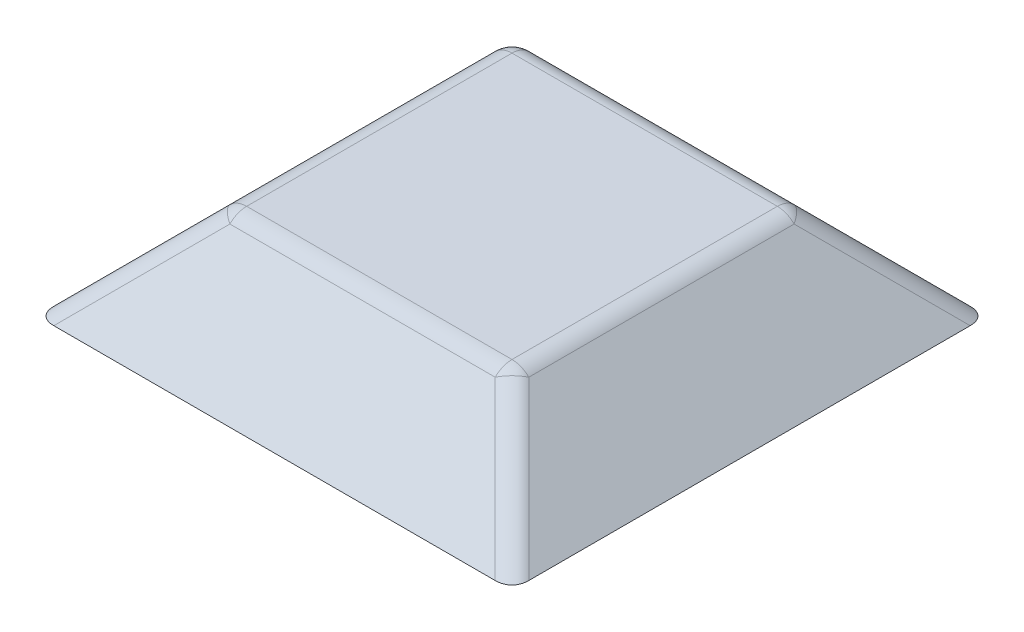
ISO-10303-21;
HEADER;
FILE_DESCRIPTION(('STEP AP214'),'2;1');
FILE_NAME('part.step','',(''),(''),'','','');
FILE_SCHEMA(('AUTOMOTIVE_DESIGN { 1 0 10303 214 1 1 1 1 }'));
ENDSEC;
DATA;
#1=APPLICATION_CONTEXT('core data for automotive mechanical design processes');
#2=APPLICATION_PROTOCOL_DEFINITION('international standard','automotive_design',2000,#1);
#3=PRODUCT_CONTEXT('',#1,'mechanical');
#4=PRODUCT('Part','Part','',(#3));
#5=PRODUCT_RELATED_PRODUCT_CATEGORY('part','',(#4));
#6=PRODUCT_DEFINITION_FORMATION('','',#4);
#7=PRODUCT_DEFINITION_CONTEXT('part definition',#1,'design');
#8=PRODUCT_DEFINITION('design','',#6,#7);
#9=PRODUCT_DEFINITION_SHAPE('','',#8);
#10=(LENGTH_UNIT() NAMED_UNIT(*) SI_UNIT(.MILLI.,.METRE.));
#11=(NAMED_UNIT(*) PLANE_ANGLE_UNIT() SI_UNIT($,.RADIAN.));
#12=(NAMED_UNIT(*) SI_UNIT($,.STERADIAN.) SOLID_ANGLE_UNIT());
#13=UNCERTAINTY_MEASURE_WITH_UNIT(LENGTH_MEASURE(1.E-05),#10,'distance_accuracy_value','');
#14=(GEOMETRIC_REPRESENTATION_CONTEXT(3) GLOBAL_UNCERTAINTY_ASSIGNED_CONTEXT((#13)) GLOBAL_UNIT_ASSIGNED_CONTEXT((#10,
#11,#12)) REPRESENTATION_CONTEXT('',''));
#15=CARTESIAN_POINT('',(0.,0.,0.));
#16=DIRECTION('',(0.,0.,1.));
#17=DIRECTION('',(1.,0.,0.));
#18=AXIS2_PLACEMENT_3D('',#15,#16,#17);
#19=CARTESIAN_POINT('',(-5.,0.,5.));
#20=DIRECTION('',(-0.707106781186546,0.707106781186549,0.));
#21=DIRECTION('',(-0.707106781186549,-0.707106781186546,0.));
#22=AXIS2_PLACEMENT_3D('',#19,#20,#21);
#23=PLANE('',#22);
#24=DIRECTION('',(0.,0.,1.));
#25=VECTOR('',#24,1.);
#26=CARTESIAN_POINT('',(-5.,0.,5.));
#27=LINE('',#26,#25);
#28=CARTESIAN_POINT('',(-5.,0.,-4.64644660940673));
#29=VERTEX_POINT('',#28);
#30=CARTESIAN_POINT('',(-5.,0.,4.64644660940673));
#31=VERTEX_POINT('',#30);
#32=EDGE_CURVE('E153',#29,#31,#27,.T.);
#33=ORIENTED_EDGE('',*,*,#32,.T.);
#34=DIRECTION('',(0.577350269189627,0.577350269189624,-0.577350269189627));
#35=VECTOR('',#34,1.);
#36=CARTESIAN_POINT('',(-5.11785113019776,-0.117851130197757,4.76429773960449));
#37=LINE('',#36,#35);
#38=CARTESIAN_POINT('',(-3.14644660940672,1.85355339059327,2.79289321881345));
#39=VERTEX_POINT('',#38);
#40=EDGE_CURVE('E11',#31,#39,#37,.T.);
#41=ORIENTED_EDGE('',*,*,#40,.T.);
#42=DIRECTION('',(0.,0.,1.));
#43=VECTOR('',#42,1.);
#44=CARTESIAN_POINT('',(-3.14644660940672,1.85355339059327,-2.99999999999999));
#45=LINE('',#44,#43);
#46=CARTESIAN_POINT('',(-3.14644660940672,1.85355339059327,-2.79289321881345));
#47=VERTEX_POINT('',#46);
#48=EDGE_CURVE('E49',#39,#47,#45,.F.);
#49=ORIENTED_EDGE('',*,*,#48,.T.);
#50=DIRECTION('',(0.577350269189627,0.577350269189624,0.577350269189627));
#51=VECTOR('',#50,1.);
#52=CARTESIAN_POINT('',(-1.78451779686442,3.21548220313557,-1.43096440627114));
#53=LINE('',#52,#51);
#54=EDGE_CURVE('E42',#47,#29,#53,.F.);
#55=ORIENTED_EDGE('',*,*,#54,.T.);
#56=EDGE_LOOP('',(#33,#41,#49,#55));
#57=FACE_BOUND('',#56,.T.);
#58=ADVANCED_FACE('F33',(#57),#23,.T.);
#59=CARTESIAN_POINT('',(5.,0.,5.));
#60=DIRECTION('',(0.,0.707106781186549,0.707106781186546));
#61=DIRECTION('',(0.,-0.707106781186546,0.707106781186549));
#62=AXIS2_PLACEMENT_3D('',#59,#60,#61);
#63=PLANE('',#62);
#64=DIRECTION('',(1.,0.,0.));
#65=VECTOR('',#64,1.);
#66=CARTESIAN_POINT('',(5.,0.,5.));
#67=LINE('',#66,#65);
#68=CARTESIAN_POINT('',(-4.64644660940673,0.,5.));
#69=VERTEX_POINT('',#68);
#70=CARTESIAN_POINT('',(4.64644660940672,0.,5.));
#71=VERTEX_POINT('',#70);
#72=EDGE_CURVE('E155',#69,#71,#67,.T.);
#73=ORIENTED_EDGE('',*,*,#72,.T.);
#74=DIRECTION('',(-0.577350269189627,0.577350269189625,-0.577350269189626));
#75=VECTOR('',#74,1.);
#76=CARTESIAN_POINT('',(4.76429773960448,-0.117851130197758,5.11785113019776));
#77=LINE('',#76,#75);
#78=CARTESIAN_POINT('',(2.79289321881344,1.85355339059327,3.14644660940672));
#79=VERTEX_POINT('',#78);
#80=EDGE_CURVE('E193',#71,#79,#77,.T.);
#81=ORIENTED_EDGE('',*,*,#80,.T.);
#82=DIRECTION('',(1.,0.,0.));
#83=VECTOR('',#82,1.);
#84=CARTESIAN_POINT('',(-3.,1.85355339059327,3.14644660940672));
#85=LINE('',#84,#83);
#86=CARTESIAN_POINT('',(-2.79289321881345,1.85355339059327,3.14644660940672));
#87=VERTEX_POINT('',#86);
#88=EDGE_CURVE('E189',#79,#87,#85,.F.);
#89=ORIENTED_EDGE('',*,*,#88,.T.);
#90=DIRECTION('',(0.577350269189626,0.577350269189624,-0.577350269189627));
#91=VECTOR('',#90,1.);
#92=CARTESIAN_POINT('',(-1.43096440627115,3.21548220313557,1.78451779686442));
#93=LINE('',#92,#91);
#94=EDGE_CURVE('E191',#87,#69,#93,.F.);
#95=ORIENTED_EDGE('',*,*,#94,.T.);
#96=EDGE_LOOP('',(#73,#81,#89,#95));
#97=FACE_BOUND('',#96,.T.);
#98=ADVANCED_FACE('F245',(#97),#63,.T.);
#99=CARTESIAN_POINT('',(5.,0.,5.));
#100=DIRECTION('',(0.707106781186546,0.707106781186549,0.));
#101=DIRECTION('',(-0.707106781186549,0.707106781186546,0.));
#102=AXIS2_PLACEMENT_3D('',#99,#100,#101);
#103=PLANE('',#102);
#104=DIRECTION('',(0.,0.,-1.));
#105=VECTOR('',#104,1.);
#106=CARTESIAN_POINT('',(5.,0.,5.));
#107=LINE('',#106,#105);
#108=CARTESIAN_POINT('',(5.,0.,4.64644660940673));
#109=VERTEX_POINT('',#108);
#110=CARTESIAN_POINT('',(5.,0.,-4.64644660940673));
#111=VERTEX_POINT('',#110);
#112=EDGE_CURVE('E159',#109,#111,#107,.T.);
#113=ORIENTED_EDGE('',*,*,#112,.T.);
#114=DIRECTION('',(-0.577350269189627,0.577350269189624,0.577350269189627));
#115=VECTOR('',#114,1.);
#116=CARTESIAN_POINT('',(1.78451779686441,3.21548220313557,-1.43096440627114));
#117=LINE('',#116,#115);
#118=CARTESIAN_POINT('',(3.14644660940672,1.85355339059327,-2.79289321881345));
#119=VERTEX_POINT('',#118);
#120=EDGE_CURVE('E179',#111,#119,#117,.T.);
#121=ORIENTED_EDGE('',*,*,#120,.T.);
#122=DIRECTION('',(0.,0.,-1.));
#123=VECTOR('',#122,1.);
#124=CARTESIAN_POINT('',(3.14644660940672,1.85355339059327,2.99999999999999));
#125=LINE('',#124,#123);
#126=CARTESIAN_POINT('',(3.14644660940672,1.85355339059327,2.79289321881345));
#127=VERTEX_POINT('',#126);
#128=EDGE_CURVE('E177',#119,#127,#125,.F.);
#129=ORIENTED_EDGE('',*,*,#128,.T.);
#130=DIRECTION('',(-0.577350269189627,0.577350269189624,-0.577350269189626));
#131=VECTOR('',#130,1.);
#132=CARTESIAN_POINT('',(5.11785113019775,-0.117851130197758,4.76429773960449));
#133=LINE('',#132,#131);
#134=EDGE_CURVE('E175',#127,#109,#133,.F.);
#135=ORIENTED_EDGE('',*,*,#134,.T.);
#136=EDGE_LOOP('',(#113,#121,#129,#135));
#137=FACE_BOUND('',#136,.T.);
#138=ADVANCED_FACE('F250',(#137),#103,.T.);
#139=CARTESIAN_POINT('',(5.,0.,-5.));
#140=DIRECTION('',(0.,0.707106781186549,-0.707106781186546));
#141=DIRECTION('',(0.,0.707106781186546,0.707106781186549));
#142=AXIS2_PLACEMENT_3D('',#139,#140,#141);
#143=PLANE('',#142);
#144=DIRECTION('',(-1.,0.,0.));
#145=VECTOR('',#144,1.);
#146=CARTESIAN_POINT('',(2.99999999999999,1.85355339059327,-3.14644660940672));
#147=LINE('',#146,#145);
#148=CARTESIAN_POINT('',(-2.79289321881345,1.85355339059327,-3.14644660940672));
#149=VERTEX_POINT('',#148);
#150=CARTESIAN_POINT('',(2.79289321881344,1.85355339059327,-3.14644660940672));
#151=VERTEX_POINT('',#150);
#152=EDGE_CURVE('E170',#149,#151,#147,.F.);
#153=ORIENTED_EDGE('',*,*,#152,.T.);
#154=DIRECTION('',(-0.577350269189627,0.577350269189624,0.577350269189627));
#155=VECTOR('',#154,1.);
#156=CARTESIAN_POINT('',(4.76429773960448,-0.117851130197758,-5.11785113019776));
#157=LINE('',#156,#155);
#158=CARTESIAN_POINT('',(4.64644660940672,0.,-5.));
#159=VERTEX_POINT('',#158);
#160=EDGE_CURVE('E173',#151,#159,#157,.F.);
#161=ORIENTED_EDGE('',*,*,#160,.T.);
#162=DIRECTION('',(-1.,0.,0.));
#163=VECTOR('',#162,1.);
#164=CARTESIAN_POINT('',(5.,0.,-5.));
#165=LINE('',#164,#163);
#166=CARTESIAN_POINT('',(-4.64644660940673,0.,-5.));
#167=VERTEX_POINT('',#166);
#168=EDGE_CURVE('E132',#159,#167,#165,.T.);
#169=ORIENTED_EDGE('',*,*,#168,.T.);
#170=DIRECTION('',(0.577350269189627,0.577350269189624,0.577350269189627));
#171=VECTOR('',#170,1.);
#172=CARTESIAN_POINT('',(-1.43096440627115,3.21548220313557,-1.78451779686442));
#173=LINE('',#172,#171);
#174=EDGE_CURVE('E168',#167,#149,#173,.T.);
#175=ORIENTED_EDGE('',*,*,#174,.T.);
#176=EDGE_LOOP('',(#153,#161,#169,#175));
#177=FACE_BOUND('',#176,.T.);
#178=ADVANCED_FACE('F226',(#177),#143,.T.);
#179=CARTESIAN_POINT('',(0.,2.,0.));
#180=DIRECTION('',(0.,1.,0.));
#181=DIRECTION('',(0.,0.,1.));
#182=AXIS2_PLACEMENT_3D('',#179,#180,#181);
#183=PLANE('',#182);
#184=DIRECTION('',(0.,0.,1.));
#185=VECTOR('',#184,1.);
#186=CARTESIAN_POINT('',(2.79289321881344,2.,-2.99999999999999));
#187=LINE('',#186,#185);
#188=CARTESIAN_POINT('',(2.79289321881344,2.,2.79289321881345));
#189=VERTEX_POINT('',#188);
#190=CARTESIAN_POINT('',(2.79289321881344,2.,-2.79289321881345));
#191=VERTEX_POINT('',#190);
#192=EDGE_CURVE('E120',#189,#191,#187,.F.);
#193=ORIENTED_EDGE('',*,*,#192,.T.);
#194=DIRECTION('',(1.,0.,0.));
#195=VECTOR('',#194,1.);
#196=CARTESIAN_POINT('',(-3.,2.,-2.79289321881345));
#197=LINE('',#196,#195);
#198=CARTESIAN_POINT('',(-2.79289321881345,2.,-2.79289321881345));
#199=VERTEX_POINT('',#198);
#200=EDGE_CURVE('E116',#191,#199,#197,.F.);
#201=ORIENTED_EDGE('',*,*,#200,.T.);
#202=DIRECTION('',(0.,0.,-1.));
#203=VECTOR('',#202,1.);
#204=CARTESIAN_POINT('',(-2.79289321881345,2.,2.99999999999999));
#205=LINE('',#204,#203);
#206=CARTESIAN_POINT('',(-2.79289321881345,2.,2.79289321881345));
#207=VERTEX_POINT('',#206);
#208=EDGE_CURVE('E110',#199,#207,#205,.F.);
#209=ORIENTED_EDGE('',*,*,#208,.T.);
#210=DIRECTION('',(-1.,0.,0.));
#211=VECTOR('',#210,1.);
#212=CARTESIAN_POINT('',(2.99999999999999,2.,2.79289321881345));
#213=LINE('',#212,#211);
#214=EDGE_CURVE('E113',#207,#189,#213,.F.);
#215=ORIENTED_EDGE('',*,*,#214,.T.);
#216=EDGE_LOOP('',(#193,#201,#209,#215));
#217=FACE_BOUND('',#216,.T.);
#218=ADVANCED_FACE('F112',(#217),#183,.T.);
#219=CARTESIAN_POINT('',(0.,0.,0.));
#220=DIRECTION('',(0.,1.,0.));
#221=DIRECTION('',(0.,0.,1.));
#222=AXIS2_PLACEMENT_3D('',#219,#220,#221);
#223=PLANE('',#222);
#224=ORIENTED_EDGE('',*,*,#168,.F.);
#225=CARTESIAN_POINT('',(4.29289321881345,0.,-4.29289321881345));
#226=DIRECTION('',(0.,1.,0.));
#227=DIRECTION('',(0.707106781186548,0.,-0.707106781186548));
#228=AXIS2_PLACEMENT_3D('',#225,#226,#227);
#229=ELLIPSE('',#228,0.866025403784441,0.5);
#230=EDGE_CURVE('E187',#159,#111,#229,.F.);
#231=ORIENTED_EDGE('',*,*,#230,.T.);
#232=ORIENTED_EDGE('',*,*,#112,.F.);
#233=CARTESIAN_POINT('',(4.29289321881345,0.,4.29289321881345));
#234=DIRECTION('',(0.,1.,0.));
#235=DIRECTION('',(0.707106781186548,0.,0.707106781186547));
#236=AXIS2_PLACEMENT_3D('',#233,#234,#235);
#237=ELLIPSE('',#236,0.866025403784441,0.5);
#238=EDGE_CURVE('E185',#109,#71,#237,.F.);
#239=ORIENTED_EDGE('',*,*,#238,.T.);
#240=ORIENTED_EDGE('',*,*,#72,.F.);
#241=CARTESIAN_POINT('',(-4.29289321881345,0.,4.29289321881345));
#242=DIRECTION('',(0.,1.,0.));
#243=DIRECTION('',(-0.707106781186547,0.,0.707106781186548));
#244=AXIS2_PLACEMENT_3D('',#241,#242,#243);
#245=ELLIPSE('',#244,0.866025403784441,0.5);
#246=EDGE_CURVE('E183',#69,#31,#245,.F.);
#247=ORIENTED_EDGE('',*,*,#246,.T.);
#248=ORIENTED_EDGE('',*,*,#32,.F.);
#249=CARTESIAN_POINT('',(-4.29289321881345,0.,-4.29289321881345));
#250=DIRECTION('',(0.,1.,0.));
#251=DIRECTION('',(-0.707106781186548,0.,-0.707106781186548));
#252=AXIS2_PLACEMENT_3D('',#249,#250,#251);
#253=ELLIPSE('',#252,0.866025403784441,0.5);
#254=EDGE_CURVE('E181',#29,#167,#253,.F.);
#255=ORIENTED_EDGE('',*,*,#254,.T.);
#256=EDGE_LOOP('',(#224,#231,#232,#239,#240,#247,#248,#255));
#257=FACE_BOUND('',#256,.T.);
#258=ADVANCED_FACE('F238',(#257),#223,.F.);
#259=CARTESIAN_POINT('',(4.76429773960448,-0.471404520791032,4.76429773960449));
#260=DIRECTION('',(0.577350269189627,-0.577350269189624,0.577350269189626));
#261=DIRECTION('',(0.707106781186547,0.,-0.707106781186548));
#262=AXIS2_PLACEMENT_3D('',#259,#260,#261);
#263=CYLINDRICAL_SURFACE('',#262,0.5);
#264=ORIENTED_EDGE('',*,*,#238,.F.);
#265=ORIENTED_EDGE('',*,*,#134,.F.);
#266=CARTESIAN_POINT('',(2.79289321881344,1.5,2.79289321881345));
#267=DIRECTION('',(-0.577350269189626,0.577350269189625,-0.577350269189627));
#268=DIRECTION('',(-0.707106781186548,0.,0.707106781186547));
#269=AXIS2_PLACEMENT_3D('',#266,#267,#268);
#270=CIRCLE('',#269,0.5);
#271=EDGE_CURVE('E37',#79,#127,#270,.T.);
#272=ORIENTED_EDGE('',*,*,#271,.F.);
#273=ORIENTED_EDGE('',*,*,#80,.F.);
#274=EDGE_LOOP('',(#264,#265,#272,#273));
#275=FACE_BOUND('',#274,.T.);
#276=ADVANCED_FACE('F35',(#275),#263,.T.);
#277=CARTESIAN_POINT('',(0.,1.5,2.79289321881345));
#278=DIRECTION('',(1.,0.,0.));
#279=DIRECTION('',(0.,0.,-1.));
#280=AXIS2_PLACEMENT_3D('',#277,#278,#279);
#281=CYLINDRICAL_SURFACE('',#280,0.5);
#282=CARTESIAN_POINT('',(-2.79289321881345,1.5,2.79289321881345));
#283=DIRECTION('',(-1.,0.,0.));
#284=DIRECTION('',(0.,0.,1.));
#285=AXIS2_PLACEMENT_3D('',#282,#283,#284);
#286=CIRCLE('',#285,0.5);
#287=EDGE_CURVE('E127',#87,#207,#286,.T.);
#288=ORIENTED_EDGE('',*,*,#287,.F.);
#289=ORIENTED_EDGE('',*,*,#88,.F.);
#290=CARTESIAN_POINT('',(2.79289321881344,1.5,2.79289321881345));
#291=DIRECTION('',(1.,0.,0.));
#292=DIRECTION('',(0.,0.,-1.));
#293=AXIS2_PLACEMENT_3D('',#290,#291,#292);
#294=CIRCLE('',#293,0.5);
#295=EDGE_CURVE('E130',#189,#79,#294,.T.);
#296=ORIENTED_EDGE('',*,*,#295,.F.);
#297=ORIENTED_EDGE('',*,*,#214,.F.);
#298=EDGE_LOOP('',(#288,#289,#296,#297));
#299=FACE_BOUND('',#298,.T.);
#300=ADVANCED_FACE('F125',(#299),#281,.T.);
#301=CARTESIAN_POINT('',(-1.43096440627115,2.8619288125423,1.43096440627115));
#302=DIRECTION('',(-0.577350269189626,-0.577350269189624,0.577350269189627));
#303=DIRECTION('',(0.707106781186548,0.,0.707106781186547));
#304=AXIS2_PLACEMENT_3D('',#301,#302,#303);
#305=CYLINDRICAL_SURFACE('',#304,0.5);
#306=ORIENTED_EDGE('',*,*,#246,.F.);
#307=ORIENTED_EDGE('',*,*,#94,.F.);
#308=CARTESIAN_POINT('',(-2.79289321881345,1.5,2.79289321881345));
#309=DIRECTION('',(0.577350269189625,0.577350269189623,-0.577350269189629));
#310=DIRECTION('',(-0.70710678118655,0.,-0.707106781186545));
#311=AXIS2_PLACEMENT_3D('',#308,#309,#310);
#312=CIRCLE('',#311,0.5);
#313=EDGE_CURVE('E138',#39,#87,#312,.T.);
#314=ORIENTED_EDGE('',*,*,#313,.F.);
#315=ORIENTED_EDGE('',*,*,#40,.F.);
#316=EDGE_LOOP('',(#306,#307,#314,#315));
#317=FACE_BOUND('',#316,.T.);
#318=ADVANCED_FACE('F243',(#317),#305,.T.);
#319=CARTESIAN_POINT('',(2.79289321881344,1.5,2.79289321881345));
#320=DIRECTION('',(0.,0.,1.));
#321=DIRECTION('',(1.,0.,0.));
#322=AXIS2_PLACEMENT_3D('',#319,#320,#321);
#323=SPHERICAL_SURFACE('',#322,0.5);
#324=ORIENTED_EDGE('',*,*,#295,.T.);
#325=ORIENTED_EDGE('',*,*,#271,.T.);
#326=CARTESIAN_POINT('',(2.79289321881344,1.5,2.79289321881345));
#327=DIRECTION('',(0.,0.,1.));
#328=DIRECTION('',(1.,0.,0.));
#329=AXIS2_PLACEMENT_3D('',#326,#327,#328);
#330=CIRCLE('',#329,0.5);
#331=EDGE_CURVE('E141',#189,#127,#330,.F.);
#332=ORIENTED_EDGE('',*,*,#331,.F.);
#333=EDGE_LOOP('',(#324,#325,#332));
#334=FACE_BOUND('',#333,.T.);
#335=ADVANCED_FACE('F291',(#334),#323,.T.);
#336=CARTESIAN_POINT('',(-2.79289321881345,1.5,2.79289321881345));
#337=DIRECTION('',(0.,0.,1.));
#338=DIRECTION('',(1.,0.,0.));
#339=AXIS2_PLACEMENT_3D('',#336,#337,#338);
#340=SPHERICAL_SURFACE('',#339,0.5);
#341=ORIENTED_EDGE('',*,*,#313,.T.);
#342=ORIENTED_EDGE('',*,*,#287,.T.);
#343=CARTESIAN_POINT('',(-2.79289321881345,1.5,2.79289321881345));
#344=DIRECTION('',(0.,0.,1.));
#345=DIRECTION('',(1.,0.,0.));
#346=AXIS2_PLACEMENT_3D('',#343,#344,#345);
#347=CIRCLE('',#346,0.5);
#348=EDGE_CURVE('E137',#39,#207,#347,.F.);
#349=ORIENTED_EDGE('',*,*,#348,.F.);
#350=EDGE_LOOP('',(#341,#342,#349));
#351=FACE_BOUND('',#350,.T.);
#352=ADVANCED_FACE('F136',(#351),#340,.T.);
#353=CARTESIAN_POINT('',(4.76429773960448,-0.471404520791032,-4.76429773960449));
#354=DIRECTION('',(0.577350269189627,-0.577350269189624,-0.577350269189627));
#355=DIRECTION('',(-0.707106781186547,0.,-0.707106781186547));
#356=AXIS2_PLACEMENT_3D('',#353,#354,#355);
#357=CYLINDRICAL_SURFACE('',#356,0.5);
#358=ORIENTED_EDGE('',*,*,#230,.F.);
#359=ORIENTED_EDGE('',*,*,#160,.F.);
#360=CARTESIAN_POINT('',(2.79289321881344,1.5,-2.79289321881345));
#361=DIRECTION('',(-0.577350269189626,0.577350269189624,0.577350269189627));
#362=DIRECTION('',(0.707106781186548,0.,0.707106781186547));
#363=AXIS2_PLACEMENT_3D('',#360,#361,#362);
#364=CIRCLE('',#363,0.5);
#365=EDGE_CURVE('E142',#119,#151,#364,.T.);
#366=ORIENTED_EDGE('',*,*,#365,.F.);
#367=ORIENTED_EDGE('',*,*,#120,.F.);
#368=EDGE_LOOP('',(#358,#359,#366,#367));
#369=FACE_BOUND('',#368,.T.);
#370=ADVANCED_FACE('F222',(#369),#357,.T.);
#371=CARTESIAN_POINT('',(2.79289321881344,1.5,0.));
#372=DIRECTION('',(0.,0.,-1.));
#373=DIRECTION('',(-1.,0.,0.));
#374=AXIS2_PLACEMENT_3D('',#371,#372,#373);
#375=CYLINDRICAL_SURFACE('',#374,0.5);
#376=ORIENTED_EDGE('',*,*,#331,.T.);
#377=ORIENTED_EDGE('',*,*,#128,.F.);
#378=CARTESIAN_POINT('',(2.79289321881344,1.5,-2.79289321881345));
#379=DIRECTION('',(0.,0.,-1.));
#380=DIRECTION('',(-1.,0.,0.));
#381=AXIS2_PLACEMENT_3D('',#378,#379,#380);
#382=CIRCLE('',#381,0.5);
#383=EDGE_CURVE('E147',#191,#119,#382,.T.);
#384=ORIENTED_EDGE('',*,*,#383,.F.);
#385=ORIENTED_EDGE('',*,*,#192,.F.);
#386=EDGE_LOOP('',(#376,#377,#384,#385));
#387=FACE_BOUND('',#386,.T.);
#388=ADVANCED_FACE('F216',(#387),#375,.T.);
#389=CARTESIAN_POINT('',(-2.79289321881345,1.5,0.));
#390=DIRECTION('',(0.,0.,1.));
#391=DIRECTION('',(1.,0.,0.));
#392=AXIS2_PLACEMENT_3D('',#389,#390,#391);
#393=CYLINDRICAL_SURFACE('',#392,0.5);
#394=ORIENTED_EDGE('',*,*,#348,.T.);
#395=ORIENTED_EDGE('',*,*,#208,.F.);
#396=CARTESIAN_POINT('',(-2.79289321881345,1.5,-2.79289321881345));
#397=DIRECTION('',(0.,0.,-1.));
#398=DIRECTION('',(-1.,0.,0.));
#399=AXIS2_PLACEMENT_3D('',#396,#397,#398);
#400=CIRCLE('',#399,0.5);
#401=EDGE_CURVE('E204',#47,#199,#400,.T.);
#402=ORIENTED_EDGE('',*,*,#401,.F.);
#403=ORIENTED_EDGE('',*,*,#48,.F.);
#404=EDGE_LOOP('',(#394,#395,#402,#403));
#405=FACE_BOUND('',#404,.T.);
#406=ADVANCED_FACE('F140',(#405),#393,.T.);
#407=CARTESIAN_POINT('',(-1.43096440627115,2.8619288125423,-1.43096440627114));
#408=DIRECTION('',(-0.577350269189627,-0.577350269189624,-0.577350269189627));
#409=DIRECTION('',(-0.707106781186547,0.,0.707106781186547));
#410=AXIS2_PLACEMENT_3D('',#407,#408,#409);
#411=CYLINDRICAL_SURFACE('',#410,0.5);
#412=ORIENTED_EDGE('',*,*,#254,.F.);
#413=ORIENTED_EDGE('',*,*,#54,.F.);
#414=CARTESIAN_POINT('',(-2.79289321881345,1.5,-2.79289321881345));
#415=DIRECTION('',(0.577350269189625,0.577350269189625,0.577350269189627));
#416=DIRECTION('',(0.707106781186549,0.,-0.707106781186546));
#417=AXIS2_PLACEMENT_3D('',#414,#415,#416);
#418=CIRCLE('',#417,0.5);
#419=EDGE_CURVE('E201',#149,#47,#418,.T.);
#420=ORIENTED_EDGE('',*,*,#419,.F.);
#421=ORIENTED_EDGE('',*,*,#174,.F.);
#422=EDGE_LOOP('',(#412,#413,#420,#421));
#423=FACE_BOUND('',#422,.T.);
#424=ADVANCED_FACE('F236',(#423),#411,.T.);
#425=CARTESIAN_POINT('',(2.79289321881344,1.5,-2.79289321881345));
#426=DIRECTION('',(0.,0.,1.));
#427=DIRECTION('',(1.,0.,0.));
#428=AXIS2_PLACEMENT_3D('',#425,#426,#427);
#429=SPHERICAL_SURFACE('',#428,0.5);
#430=ORIENTED_EDGE('',*,*,#383,.T.);
#431=ORIENTED_EDGE('',*,*,#365,.T.);
#432=CARTESIAN_POINT('',(2.79289321881344,1.5,-2.79289321881345));
#433=DIRECTION('',(1.,0.,0.));
#434=DIRECTION('',(0.,0.,-1.));
#435=AXIS2_PLACEMENT_3D('',#432,#433,#434);
#436=CIRCLE('',#435,0.5);
#437=EDGE_CURVE('E199',#191,#151,#436,.F.);
#438=ORIENTED_EDGE('',*,*,#437,.F.);
#439=EDGE_LOOP('',(#430,#431,#438));
#440=FACE_BOUND('',#439,.T.);
#441=ADVANCED_FACE('F210',(#440),#429,.T.);
#442=CARTESIAN_POINT('',(-2.79289321881345,1.5,-2.79289321881345));
#443=DIRECTION('',(0.,0.,1.));
#444=DIRECTION('',(1.,0.,0.));
#445=AXIS2_PLACEMENT_3D('',#442,#443,#444);
#446=SPHERICAL_SURFACE('',#445,0.5);
#447=ORIENTED_EDGE('',*,*,#419,.T.);
#448=ORIENTED_EDGE('',*,*,#401,.T.);
#449=CARTESIAN_POINT('',(-2.79289321881345,1.5,-2.79289321881345));
#450=DIRECTION('',(-1.,0.,0.));
#451=DIRECTION('',(0.,0.,1.));
#452=AXIS2_PLACEMENT_3D('',#449,#450,#451);
#453=CIRCLE('',#452,0.5);
#454=EDGE_CURVE('E197',#149,#199,#453,.F.);
#455=ORIENTED_EDGE('',*,*,#454,.F.);
#456=EDGE_LOOP('',(#447,#448,#455));
#457=FACE_BOUND('',#456,.T.);
#458=ADVANCED_FACE('F233',(#457),#446,.T.);
#459=CARTESIAN_POINT('',(0.,1.5,-2.79289321881345));
#460=DIRECTION('',(-1.,0.,0.));
#461=DIRECTION('',(0.,0.,1.));
#462=AXIS2_PLACEMENT_3D('',#459,#460,#461);
#463=CYLINDRICAL_SURFACE('',#462,0.5);
#464=ORIENTED_EDGE('',*,*,#437,.T.);
#465=ORIENTED_EDGE('',*,*,#152,.F.);
#466=ORIENTED_EDGE('',*,*,#454,.T.);
#467=ORIENTED_EDGE('',*,*,#200,.F.);
#468=EDGE_LOOP('',(#464,#465,#466,#467));
#469=FACE_BOUND('',#468,.T.);
#470=ADVANCED_FACE('F231',(#469),#463,.T.);
#471=CLOSED_SHELL('',(#58,#98,#138,#178,#218,#258,#276,#300,#318,#335,#352,#370,#388,#406,#424,
#441,#458,#470));
#472=MANIFOLD_SOLID_BREP('B2',#471);
#473=ADVANCED_BREP_SHAPE_REPRESENTATION('',(#18,#472),#14);
#474=SHAPE_DEFINITION_REPRESENTATION(#9,#473);
ENDSEC;
END-ISO-10303-21;
